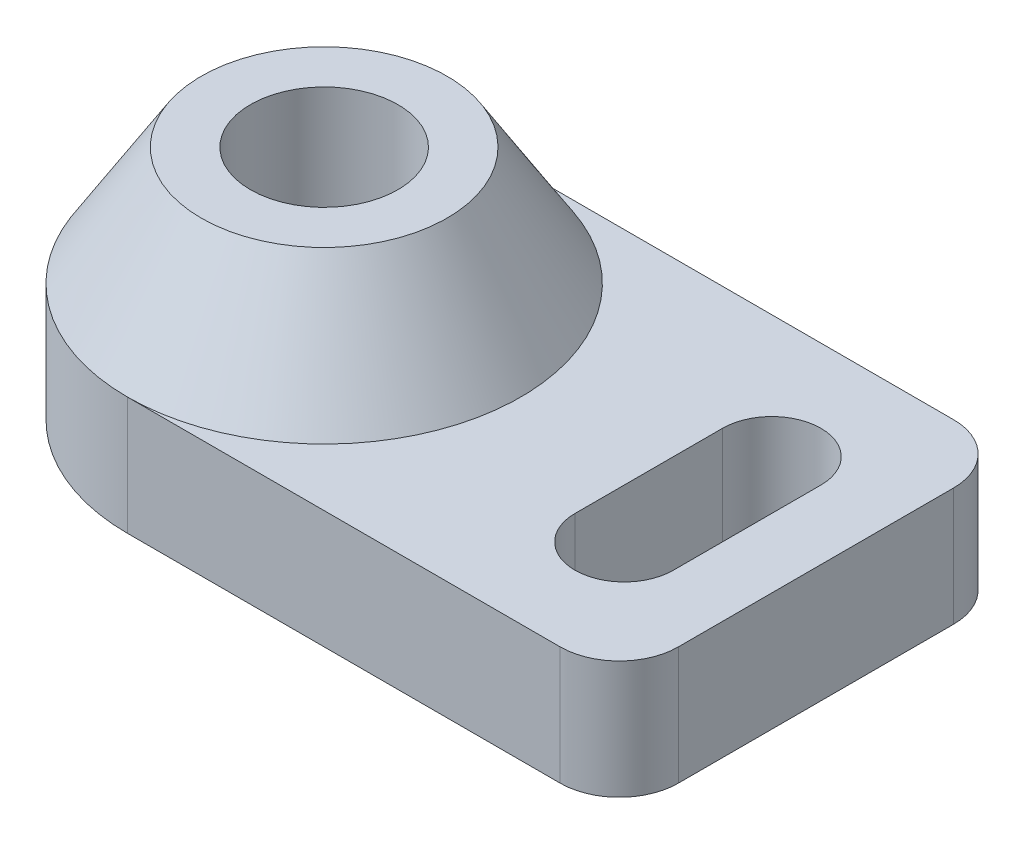
ISO-10303-21;
HEADER;
FILE_DESCRIPTION(('STEP AP214'),'2;1');
FILE_NAME('part.step','',(''),(''),'','','');
FILE_SCHEMA(('AUTOMOTIVE_DESIGN { 1 0 10303 214 1 1 1 1 }'));
ENDSEC;
DATA;
#1=APPLICATION_CONTEXT('core data for automotive mechanical design processes');
#2=APPLICATION_PROTOCOL_DEFINITION('international standard','automotive_design',2000,#1);
#3=PRODUCT_CONTEXT('',#1,'mechanical');
#4=PRODUCT('Part','Part','',(#3));
#5=PRODUCT_RELATED_PRODUCT_CATEGORY('part','',(#4));
#6=PRODUCT_DEFINITION_FORMATION('','',#4);
#7=PRODUCT_DEFINITION_CONTEXT('part definition',#1,'design');
#8=PRODUCT_DEFINITION('design','',#6,#7);
#9=PRODUCT_DEFINITION_SHAPE('','',#8);
#10=(LENGTH_UNIT() NAMED_UNIT(*) SI_UNIT(.MILLI.,.METRE.));
#11=(NAMED_UNIT(*) PLANE_ANGLE_UNIT() SI_UNIT($,.RADIAN.));
#12=(NAMED_UNIT(*) SI_UNIT($,.STERADIAN.) SOLID_ANGLE_UNIT());
#13=UNCERTAINTY_MEASURE_WITH_UNIT(LENGTH_MEASURE(1.E-05),#10,'distance_accuracy_value','');
#14=(GEOMETRIC_REPRESENTATION_CONTEXT(3) GLOBAL_UNCERTAINTY_ASSIGNED_CONTEXT((#13)) GLOBAL_UNIT_ASSIGNED_CONTEXT((#10,
#11,#12)) REPRESENTATION_CONTEXT('',''));
#15=CARTESIAN_POINT('',(0.,0.,0.));
#16=DIRECTION('',(0.,0.,1.));
#17=DIRECTION('',(1.,0.,0.));
#18=AXIS2_PLACEMENT_3D('',#15,#16,#17);
#19=CARTESIAN_POINT('',(0.,6.,-20.));
#20=DIRECTION('',(0.,0.,1.));
#21=DIRECTION('',(1.,0.,0.));
#22=AXIS2_PLACEMENT_3D('',#19,#20,#21);
#23=PLANE('',#22);
#24=DIRECTION('',(-1.,0.,0.));
#25=VECTOR('',#24,1.);
#26=CARTESIAN_POINT('',(0.,6.,-20.));
#27=LINE('',#26,#25);
#28=CARTESIAN_POINT('',(-3.,6.,-20.));
#29=VERTEX_POINT('',#28);
#30=CARTESIAN_POINT('',(-25.,6.,-20.));
#31=VERTEX_POINT('',#30);
#32=EDGE_CURVE('E154',#29,#31,#27,.T.);
#33=ORIENTED_EDGE('',*,*,#32,.F.);
#34=DIRECTION('',(0.,-1.,0.));
#35=VECTOR('',#34,1.);
#36=CARTESIAN_POINT('',(-3.,6.,-20.));
#37=LINE('',#36,#35);
#38=CARTESIAN_POINT('',(-3.,0.,-20.));
#39=VERTEX_POINT('',#38);
#40=EDGE_CURVE('E195',#29,#39,#37,.T.);
#41=ORIENTED_EDGE('',*,*,#40,.T.);
#42=DIRECTION('',(-1.,0.,0.));
#43=VECTOR('',#42,1.);
#44=CARTESIAN_POINT('',(0.,0.,-20.));
#45=LINE('',#44,#43);
#46=CARTESIAN_POINT('',(-25.,0.,-20.));
#47=VERTEX_POINT('',#46);
#48=EDGE_CURVE('E170',#39,#47,#45,.T.);
#49=ORIENTED_EDGE('',*,*,#48,.T.);
#50=DIRECTION('',(0.,-1.,0.));
#51=VECTOR('',#50,1.);
#52=CARTESIAN_POINT('',(-25.,6.,-20.));
#53=LINE('',#52,#51);
#54=EDGE_CURVE('E136',#31,#47,#53,.T.);
#55=ORIENTED_EDGE('',*,*,#54,.F.);
#56=EDGE_LOOP('',(#33,#41,#49,#55));
#57=FACE_BOUND('',#56,.T.);
#58=ADVANCED_FACE('F45',(#57),#23,.F.);
#59=CARTESIAN_POINT('',(-25.,6.,-10.));
#60=DIRECTION('',(0.,-1.,0.));
#61=DIRECTION('',(0.,0.,-1.));
#62=AXIS2_PLACEMENT_3D('',#59,#60,#61);
#63=CYLINDRICAL_SURFACE('',#62,10.);
#64=CARTESIAN_POINT('',(-25.,0.,-10.));
#65=DIRECTION('',(0.,1.,0.));
#66=DIRECTION('',(0.,0.,1.));
#67=AXIS2_PLACEMENT_3D('',#64,#65,#66);
#68=CIRCLE('',#67,10.);
#69=CARTESIAN_POINT('',(-25.,0.,0.));
#70=VERTEX_POINT('',#69);
#71=EDGE_CURVE('E132',#47,#70,#68,.T.);
#72=ORIENTED_EDGE('',*,*,#71,.T.);
#73=DIRECTION('',(0.,-1.,0.));
#74=VECTOR('',#73,1.);
#75=CARTESIAN_POINT('',(-25.,6.,0.));
#76=LINE('',#75,#74);
#77=CARTESIAN_POINT('',(-25.,6.,0.));
#78=VERTEX_POINT('',#77);
#79=EDGE_CURVE('E124',#78,#70,#76,.T.);
#80=ORIENTED_EDGE('',*,*,#79,.F.);
#81=CARTESIAN_POINT('',(-25.,6.,-10.));
#82=DIRECTION('',(0.,1.,0.));
#83=DIRECTION('',(0.,0.,1.));
#84=AXIS2_PLACEMENT_3D('',#81,#82,#83);
#85=CIRCLE('',#84,10.);
#86=EDGE_CURVE('E129',#31,#78,#85,.T.);
#87=ORIENTED_EDGE('',*,*,#86,.F.);
#88=ORIENTED_EDGE('',*,*,#54,.T.);
#89=EDGE_LOOP('',(#72,#80,#87,#88));
#90=FACE_BOUND('',#89,.T.);
#91=ADVANCED_FACE('F126',(#90),#63,.T.);
#92=CARTESIAN_POINT('',(0.,6.,0.));
#93=DIRECTION('',(0.,0.,1.));
#94=DIRECTION('',(1.,0.,0.));
#95=AXIS2_PLACEMENT_3D('',#92,#93,#94);
#96=PLANE('',#95);
#97=DIRECTION('',(-1.,0.,0.));
#98=VECTOR('',#97,1.);
#99=CARTESIAN_POINT('',(0.,0.,0.));
#100=LINE('',#99,#98);
#101=CARTESIAN_POINT('',(-3.,0.,0.));
#102=VERTEX_POINT('',#101);
#103=EDGE_CURVE('E176',#102,#70,#100,.T.);
#104=ORIENTED_EDGE('',*,*,#103,.F.);
#105=DIRECTION('',(0.,-1.,0.));
#106=VECTOR('',#105,1.);
#107=CARTESIAN_POINT('',(-3.,6.,0.));
#108=LINE('',#107,#106);
#109=CARTESIAN_POINT('',(-3.,6.,0.));
#110=VERTEX_POINT('',#109);
#111=EDGE_CURVE('E144',#102,#110,#108,.F.);
#112=ORIENTED_EDGE('',*,*,#111,.T.);
#113=DIRECTION('',(-1.,0.,0.));
#114=VECTOR('',#113,1.);
#115=CARTESIAN_POINT('',(0.,6.,0.));
#116=LINE('',#115,#114);
#117=EDGE_CURVE('E140',#110,#78,#116,.T.);
#118=ORIENTED_EDGE('',*,*,#117,.T.);
#119=ORIENTED_EDGE('',*,*,#79,.T.);
#120=EDGE_LOOP('',(#104,#112,#118,#119));
#121=FACE_BOUND('',#120,.T.);
#122=ADVANCED_FACE('F142',(#121),#96,.T.);
#123=CARTESIAN_POINT('',(0.,6.,0.));
#124=DIRECTION('',(-1.,0.,0.));
#125=DIRECTION('',(0.,0.,1.));
#126=AXIS2_PLACEMENT_3D('',#123,#124,#125);
#127=PLANE('',#126);
#128=DIRECTION('',(0.,0.,-1.));
#129=VECTOR('',#128,1.);
#130=CARTESIAN_POINT('',(0.,0.,0.));
#131=LINE('',#130,#129);
#132=CARTESIAN_POINT('',(0.,0.,-3.));
#133=VERTEX_POINT('',#132);
#134=CARTESIAN_POINT('',(0.,0.,-17.));
#135=VERTEX_POINT('',#134);
#136=EDGE_CURVE('E164',#133,#135,#131,.T.);
#137=ORIENTED_EDGE('',*,*,#136,.T.);
#138=DIRECTION('',(0.,-1.,0.));
#139=VECTOR('',#138,1.);
#140=CARTESIAN_POINT('',(0.,6.,-17.));
#141=LINE('',#140,#139);
#142=CARTESIAN_POINT('',(0.,6.,-17.));
#143=VERTEX_POINT('',#142);
#144=EDGE_CURVE('E54',#135,#143,#141,.F.);
#145=ORIENTED_EDGE('',*,*,#144,.T.);
#146=DIRECTION('',(0.,0.,-1.));
#147=VECTOR('',#146,1.);
#148=CARTESIAN_POINT('',(0.,6.,0.));
#149=LINE('',#148,#147);
#150=CARTESIAN_POINT('',(0.,6.,-3.));
#151=VERTEX_POINT('',#150);
#152=EDGE_CURVE('E137',#151,#143,#149,.T.);
#153=ORIENTED_EDGE('',*,*,#152,.F.);
#154=DIRECTION('',(0.,-1.,0.));
#155=VECTOR('',#154,1.);
#156=CARTESIAN_POINT('',(0.,0.,-3.));
#157=LINE('',#156,#155);
#158=EDGE_CURVE('E183',#151,#133,#157,.T.);
#159=ORIENTED_EDGE('',*,*,#158,.T.);
#160=EDGE_LOOP('',(#137,#145,#153,#159));
#161=FACE_BOUND('',#160,.T.);
#162=ADVANCED_FACE('F209',(#161),#127,.F.);
#163=CARTESIAN_POINT('',(0.,6.,0.));
#164=DIRECTION('',(0.,1.,0.));
#165=DIRECTION('',(0.,0.,1.));
#166=AXIS2_PLACEMENT_3D('',#163,#164,#165);
#167=PLANE('',#166);
#168=CARTESIAN_POINT('',(-25.,6.,-10.));
#169=DIRECTION('',(0.,1.,0.));
#170=DIRECTION('',(0.,0.,1.));
#171=AXIS2_PLACEMENT_3D('',#168,#169,#170);
#172=CIRCLE('',#171,10.);
#173=EDGE_CURVE('E150',#78,#31,#172,.T.);
#174=ORIENTED_EDGE('',*,*,#173,.F.);
#175=ORIENTED_EDGE('',*,*,#117,.F.);
#176=CARTESIAN_POINT('',(-3.,6.,-3.));
#177=DIRECTION('',(0.,1.,0.));
#178=DIRECTION('',(0.,0.,1.));
#179=AXIS2_PLACEMENT_3D('',#176,#177,#178);
#180=CIRCLE('',#179,3.);
#181=EDGE_CURVE('E192',#110,#151,#180,.T.);
#182=ORIENTED_EDGE('',*,*,#181,.T.);
#183=ORIENTED_EDGE('',*,*,#152,.T.);
#184=CARTESIAN_POINT('',(-3.,6.,-17.));
#185=DIRECTION('',(0.,1.,0.));
#186=DIRECTION('',(0.,0.,1.));
#187=AXIS2_PLACEMENT_3D('',#184,#185,#186);
#188=CIRCLE('',#187,3.);
#189=EDGE_CURVE('E11',#143,#29,#188,.T.);
#190=ORIENTED_EDGE('',*,*,#189,.T.);
#191=ORIENTED_EDGE('',*,*,#32,.T.);
#192=EDGE_LOOP('',(#174,#175,#182,#183,#190,#191));
#193=FACE_BOUND('',#192,.T.);
#194=CARTESIAN_POINT('',(-6.,6.,-13.75));
#195=DIRECTION('',(0.,1.,0.));
#196=DIRECTION('',(0.,0.,1.));
#197=AXIS2_PLACEMENT_3D('',#194,#195,#196);
#198=CIRCLE('',#197,2.5);
#199=CARTESIAN_POINT('',(-3.5,6.,-13.75));
#200=VERTEX_POINT('',#199);
#201=CARTESIAN_POINT('',(-8.5,6.,-13.75));
#202=VERTEX_POINT('',#201);
#203=EDGE_CURVE('E272',#200,#202,#198,.T.);
#204=ORIENTED_EDGE('',*,*,#203,.F.);
#205=DIRECTION('',(0.,0.,-1.));
#206=VECTOR('',#205,1.);
#207=CARTESIAN_POINT('',(-3.5,6.,-13.75));
#208=LINE('',#207,#206);
#209=CARTESIAN_POINT('',(-3.5,6.,-6.25));
#210=VERTEX_POINT('',#209);
#211=EDGE_CURVE('E259',#210,#200,#208,.T.);
#212=ORIENTED_EDGE('',*,*,#211,.F.);
#213=CARTESIAN_POINT('',(-6.,6.,-6.25));
#214=DIRECTION('',(0.,1.,0.));
#215=DIRECTION('',(0.,0.,1.));
#216=AXIS2_PLACEMENT_3D('',#213,#214,#215);
#217=CIRCLE('',#216,2.5);
#218=CARTESIAN_POINT('',(-8.5,6.,-6.25));
#219=VERTEX_POINT('',#218);
#220=EDGE_CURVE('E269',#219,#210,#217,.T.);
#221=ORIENTED_EDGE('',*,*,#220,.F.);
#222=DIRECTION('',(0.,0.,1.));
#223=VECTOR('',#222,1.);
#224=CARTESIAN_POINT('',(-8.5,6.,-13.75));
#225=LINE('',#224,#223);
#226=EDGE_CURVE('E274',#202,#219,#225,.T.);
#227=ORIENTED_EDGE('',*,*,#226,.F.);
#228=EDGE_LOOP('',(#204,#212,#221,#227));
#229=FACE_BOUND('',#228,.T.);
#230=ADVANCED_FACE('F151',(#193,#229),#167,.T.);
#231=CARTESIAN_POINT('',(0.,0.,0.));
#232=DIRECTION('',(0.,1.,0.));
#233=DIRECTION('',(0.,0.,1.));
#234=AXIS2_PLACEMENT_3D('',#231,#232,#233);
#235=PLANE('',#234);
#236=CARTESIAN_POINT('',(-25.,0.,-10.));
#237=DIRECTION('',(0.,1.,0.));
#238=DIRECTION('',(0.,0.,1.));
#239=AXIS2_PLACEMENT_3D('',#236,#237,#238);
#240=CIRCLE('',#239,3.75);
#241=CARTESIAN_POINT('',(-25.,0.,-6.25));
#242=VERTEX_POINT('',#241);
#243=EDGE_CURVE('E277',#242,#242,#240,.T.);
#244=ORIENTED_EDGE('',*,*,#243,.T.);
#245=EDGE_LOOP('',(#244));
#246=FACE_BOUND('',#245,.T.);
#247=DIRECTION('',(0.,0.,-1.));
#248=VECTOR('',#247,1.);
#249=CARTESIAN_POINT('',(-3.5,0.,-13.75));
#250=LINE('',#249,#248);
#251=CARTESIAN_POINT('',(-3.5,0.,-6.25));
#252=VERTEX_POINT('',#251);
#253=CARTESIAN_POINT('',(-3.5,0.,-13.75));
#254=VERTEX_POINT('',#253);
#255=EDGE_CURVE('E285',#252,#254,#250,.T.);
#256=ORIENTED_EDGE('',*,*,#255,.T.);
#257=CARTESIAN_POINT('',(-6.,0.,-13.75));
#258=DIRECTION('',(0.,1.,0.));
#259=DIRECTION('',(0.,0.,1.));
#260=AXIS2_PLACEMENT_3D('',#257,#258,#259);
#261=CIRCLE('',#260,2.5);
#262=CARTESIAN_POINT('',(-8.5,0.,-13.75));
#263=VERTEX_POINT('',#262);
#264=EDGE_CURVE('E268',#254,#263,#261,.T.);
#265=ORIENTED_EDGE('',*,*,#264,.T.);
#266=DIRECTION('',(0.,0.,1.));
#267=VECTOR('',#266,1.);
#268=CARTESIAN_POINT('',(-8.5,0.,-13.75));
#269=LINE('',#268,#267);
#270=CARTESIAN_POINT('',(-8.5,0.,-6.25));
#271=VERTEX_POINT('',#270);
#272=EDGE_CURVE('E312',#263,#271,#269,.T.);
#273=ORIENTED_EDGE('',*,*,#272,.T.);
#274=CARTESIAN_POINT('',(-6.,0.,-6.25));
#275=DIRECTION('',(0.,1.,0.));
#276=DIRECTION('',(0.,0.,1.));
#277=AXIS2_PLACEMENT_3D('',#274,#275,#276);
#278=CIRCLE('',#277,2.5);
#279=EDGE_CURVE('E315',#271,#252,#278,.T.);
#280=ORIENTED_EDGE('',*,*,#279,.T.);
#281=EDGE_LOOP('',(#256,#265,#273,#280));
#282=FACE_BOUND('',#281,.T.);
#283=ORIENTED_EDGE('',*,*,#48,.F.);
#284=CARTESIAN_POINT('',(-3.,0.,-17.));
#285=DIRECTION('',(0.,1.,0.));
#286=DIRECTION('',(0.,0.,1.));
#287=AXIS2_PLACEMENT_3D('',#284,#285,#286);
#288=CIRCLE('',#287,3.);
#289=EDGE_CURVE('E68',#39,#135,#288,.F.);
#290=ORIENTED_EDGE('',*,*,#289,.T.);
#291=ORIENTED_EDGE('',*,*,#136,.F.);
#292=CARTESIAN_POINT('',(-3.,0.,-3.));
#293=DIRECTION('',(0.,1.,0.));
#294=DIRECTION('',(0.,0.,1.));
#295=AXIS2_PLACEMENT_3D('',#292,#293,#294);
#296=CIRCLE('',#295,3.);
#297=EDGE_CURVE('E187',#133,#102,#296,.F.);
#298=ORIENTED_EDGE('',*,*,#297,.T.);
#299=ORIENTED_EDGE('',*,*,#103,.T.);
#300=ORIENTED_EDGE('',*,*,#71,.F.);
#301=EDGE_LOOP('',(#283,#290,#291,#298,#299,#300));
#302=FACE_BOUND('',#301,.T.);
#303=ADVANCED_FACE('F205',(#246,#282,#302),#235,.F.);
#304=CARTESIAN_POINT('',(-25.,12.,-10.));
#305=DIRECTION('',(0.,-1.,0.));
#306=DIRECTION('',(0.,0.,-1.));
#307=AXIS2_PLACEMENT_3D('',#304,#305,#306);
#308=CYLINDRICAL_SURFACE('',#307,3.75);
#309=CARTESIAN_POINT('',(-25.,12.,-10.));
#310=DIRECTION('',(0.,1.,0.));
#311=DIRECTION('',(0.,0.,1.));
#312=AXIS2_PLACEMENT_3D('',#309,#310,#311);
#313=CIRCLE('',#312,3.75);
#314=CARTESIAN_POINT('',(-25.,12.,-6.25));
#315=VERTEX_POINT('',#314);
#316=EDGE_CURVE('E173',#315,#315,#313,.T.);
#317=ORIENTED_EDGE('',*,*,#316,.T.);
#318=EDGE_LOOP('',(#317));
#319=FACE_BOUND('',#318,.T.);
#320=ORIENTED_EDGE('',*,*,#243,.F.);
#321=EDGE_LOOP('',(#320));
#322=FACE_BOUND('',#321,.T.);
#323=ADVANCED_FACE('F230',(#319,#322),#308,.F.);
#324=CARTESIAN_POINT('',(0.,12.,0.));
#325=DIRECTION('',(0.,1.,0.));
#326=DIRECTION('',(0.,0.,1.));
#327=AXIS2_PLACEMENT_3D('',#324,#325,#326);
#328=PLANE('',#327);
#329=ORIENTED_EDGE('',*,*,#316,.F.);
#330=EDGE_LOOP('',(#329));
#331=FACE_BOUND('',#330,.T.);
#332=CARTESIAN_POINT('',(-25.,12.,-10.));
#333=DIRECTION('',(0.,1.,0.));
#334=DIRECTION('',(0.,0.,1.));
#335=AXIS2_PLACEMENT_3D('',#332,#333,#334);
#336=CIRCLE('',#335,6.25);
#337=CARTESIAN_POINT('',(-25.,12.,-3.75));
#338=VERTEX_POINT('',#337);
#339=EDGE_CURVE('E157',#338,#338,#336,.T.);
#340=ORIENTED_EDGE('',*,*,#339,.T.);
#341=EDGE_LOOP('',(#340));
#342=FACE_BOUND('',#341,.T.);
#343=ADVANCED_FACE('F236',(#331,#342),#328,.T.);
#344=CARTESIAN_POINT('',(-6.,0.,-13.75));
#345=DIRECTION('',(0.,1.,0.));
#346=DIRECTION('',(0.,0.,1.));
#347=AXIS2_PLACEMENT_3D('',#344,#345,#346);
#348=CYLINDRICAL_SURFACE('',#347,2.5);
#349=ORIENTED_EDGE('',*,*,#203,.T.);
#350=DIRECTION('',(0.,1.,0.));
#351=VECTOR('',#350,1.);
#352=CARTESIAN_POINT('',(-8.5,0.,-13.75));
#353=LINE('',#352,#351);
#354=EDGE_CURVE('E297',#263,#202,#353,.T.);
#355=ORIENTED_EDGE('',*,*,#354,.F.);
#356=ORIENTED_EDGE('',*,*,#264,.F.);
#357=DIRECTION('',(0.,1.,0.));
#358=VECTOR('',#357,1.);
#359=CARTESIAN_POINT('',(-3.5,0.,-13.75));
#360=LINE('',#359,#358);
#361=EDGE_CURVE('E262',#254,#200,#360,.T.);
#362=ORIENTED_EDGE('',*,*,#361,.T.);
#363=EDGE_LOOP('',(#349,#355,#356,#362));
#364=FACE_BOUND('',#363,.T.);
#365=ADVANCED_FACE('F240',(#364),#348,.F.);
#366=CARTESIAN_POINT('',(-3.5,0.,-13.75));
#367=DIRECTION('',(1.,0.,0.));
#368=DIRECTION('',(0.,0.,-1.));
#369=AXIS2_PLACEMENT_3D('',#366,#367,#368);
#370=PLANE('',#369);
#371=ORIENTED_EDGE('',*,*,#211,.T.);
#372=ORIENTED_EDGE('',*,*,#361,.F.);
#373=ORIENTED_EDGE('',*,*,#255,.F.);
#374=DIRECTION('',(0.,1.,0.));
#375=VECTOR('',#374,1.);
#376=CARTESIAN_POINT('',(-3.5,0.,-6.25));
#377=LINE('',#376,#375);
#378=EDGE_CURVE('E264',#252,#210,#377,.T.);
#379=ORIENTED_EDGE('',*,*,#378,.T.);
#380=EDGE_LOOP('',(#371,#372,#373,#379));
#381=FACE_BOUND('',#380,.T.);
#382=ADVANCED_FACE('F244',(#381),#370,.F.);
#383=CARTESIAN_POINT('',(-6.,0.,-6.25));
#384=DIRECTION('',(0.,1.,0.));
#385=DIRECTION('',(0.,0.,1.));
#386=AXIS2_PLACEMENT_3D('',#383,#384,#385);
#387=CYLINDRICAL_SURFACE('',#386,2.5);
#388=ORIENTED_EDGE('',*,*,#220,.T.);
#389=ORIENTED_EDGE('',*,*,#378,.F.);
#390=ORIENTED_EDGE('',*,*,#279,.F.);
#391=DIRECTION('',(0.,1.,0.));
#392=VECTOR('',#391,1.);
#393=CARTESIAN_POINT('',(-8.5,0.,-6.25));
#394=LINE('',#393,#392);
#395=EDGE_CURVE('E294',#271,#219,#394,.T.);
#396=ORIENTED_EDGE('',*,*,#395,.T.);
#397=EDGE_LOOP('',(#388,#389,#390,#396));
#398=FACE_BOUND('',#397,.T.);
#399=ADVANCED_FACE('F248',(#398),#387,.F.);
#400=CARTESIAN_POINT('',(-8.5,0.,-13.75));
#401=DIRECTION('',(-1.,0.,0.));
#402=DIRECTION('',(0.,0.,1.));
#403=AXIS2_PLACEMENT_3D('',#400,#401,#402);
#404=PLANE('',#403);
#405=ORIENTED_EDGE('',*,*,#226,.T.);
#406=ORIENTED_EDGE('',*,*,#395,.F.);
#407=ORIENTED_EDGE('',*,*,#272,.F.);
#408=ORIENTED_EDGE('',*,*,#354,.T.);
#409=EDGE_LOOP('',(#405,#406,#407,#408));
#410=FACE_BOUND('',#409,.T.);
#411=ADVANCED_FACE('F216',(#410),#404,.F.);
#412=CARTESIAN_POINT('',(-3.,6.,-3.));
#413=DIRECTION('',(0.,1.,0.));
#414=DIRECTION('',(0.,0.,1.));
#415=AXIS2_PLACEMENT_3D('',#412,#413,#414);
#416=CYLINDRICAL_SURFACE('',#415,3.);
#417=ORIENTED_EDGE('',*,*,#181,.F.);
#418=ORIENTED_EDGE('',*,*,#111,.F.);
#419=ORIENTED_EDGE('',*,*,#297,.F.);
#420=ORIENTED_EDGE('',*,*,#158,.F.);
#421=EDGE_LOOP('',(#417,#418,#419,#420));
#422=FACE_BOUND('',#421,.T.);
#423=ADVANCED_FACE('F207',(#422),#416,.T.);
#424=CARTESIAN_POINT('',(-3.,6.,-17.));
#425=DIRECTION('',(0.,-1.,0.));
#426=DIRECTION('',(0.,0.,-1.));
#427=AXIS2_PLACEMENT_3D('',#424,#425,#426);
#428=CYLINDRICAL_SURFACE('',#427,3.);
#429=ORIENTED_EDGE('',*,*,#189,.F.);
#430=ORIENTED_EDGE('',*,*,#144,.F.);
#431=ORIENTED_EDGE('',*,*,#289,.F.);
#432=ORIENTED_EDGE('',*,*,#40,.F.);
#433=EDGE_LOOP('',(#429,#430,#431,#432));
#434=FACE_BOUND('',#433,.T.);
#435=ADVANCED_FACE('F47',(#434),#428,.T.);
#436=CARTESIAN_POINT('',(-25.,12.,-10.));
#437=DIRECTION('',(0.,-1.,0.));
#438=DIRECTION('',(0.,0.,-1.));
#439=AXIS2_PLACEMENT_3D('',#436,#437,#438);
#440=CONICAL_SURFACE('',#439,6.25,0.558599315343563);
#441=ORIENTED_EDGE('',*,*,#173,.T.);
#442=ORIENTED_EDGE('',*,*,#86,.T.);
#443=EDGE_LOOP('',(#441,#442));
#444=FACE_BOUND('',#443,.T.);
#445=ORIENTED_EDGE('',*,*,#339,.F.);
#446=EDGE_LOOP('',(#445));
#447=FACE_BOUND('',#446,.T.);
#448=ADVANCED_FACE('F159',(#444,#447),#440,.T.);
#449=CLOSED_SHELL('',(#58,#91,#122,#162,#230,#303,#323,#343,#365,#382,#399,#411,#423,#435,#448));
#450=MANIFOLD_SOLID_BREP('B2',#449);
#451=ADVANCED_BREP_SHAPE_REPRESENTATION('',(#18,#450),#14);
#452=SHAPE_DEFINITION_REPRESENTATION(#9,#451);
ENDSEC;
END-ISO-10303-21;
